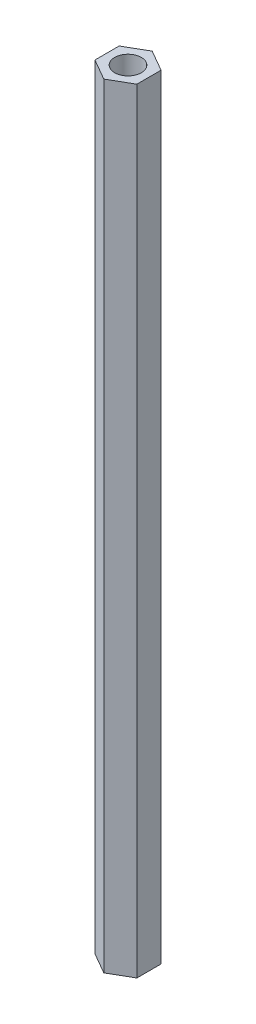
ISO-10303-21;
HEADER;
FILE_DESCRIPTION(('STEP AP214'),'2;1');
FILE_NAME('part.step','',(''),(''),'','','');
FILE_SCHEMA(('AUTOMOTIVE_DESIGN { 1 0 10303 214 1 1 1 1 }'));
ENDSEC;
DATA;
#1=APPLICATION_CONTEXT('core data for automotive mechanical design processes');
#2=APPLICATION_PROTOCOL_DEFINITION('international standard','automotive_design',2000,#1);
#3=PRODUCT_CONTEXT('',#1,'mechanical');
#4=PRODUCT('Part','Part','',(#3));
#5=PRODUCT_RELATED_PRODUCT_CATEGORY('part','',(#4));
#6=PRODUCT_DEFINITION_FORMATION('','',#4);
#7=PRODUCT_DEFINITION_CONTEXT('part definition',#1,'design');
#8=PRODUCT_DEFINITION('design','',#6,#7);
#9=PRODUCT_DEFINITION_SHAPE('','',#8);
#10=(LENGTH_UNIT() NAMED_UNIT(*) SI_UNIT(.MILLI.,.METRE.));
#11=(NAMED_UNIT(*) PLANE_ANGLE_UNIT() SI_UNIT($,.RADIAN.));
#12=(NAMED_UNIT(*) SI_UNIT($,.STERADIAN.) SOLID_ANGLE_UNIT());
#13=UNCERTAINTY_MEASURE_WITH_UNIT(LENGTH_MEASURE(1.E-05),#10,'distance_accuracy_value','');
#14=(GEOMETRIC_REPRESENTATION_CONTEXT(3) GLOBAL_UNCERTAINTY_ASSIGNED_CONTEXT((#13)) GLOBAL_UNIT_ASSIGNED_CONTEXT((#10,
#11,#12)) REPRESENTATION_CONTEXT('',''));
#15=CARTESIAN_POINT('',(0.,0.,0.));
#16=DIRECTION('',(0.,0.,1.));
#17=DIRECTION('',(1.,0.,0.));
#18=AXIS2_PLACEMENT_3D('',#15,#16,#17);
#19=CARTESIAN_POINT('',(0.,101.6,0.));
#20=DIRECTION('',(0.,1.,0.));
#21=DIRECTION('',(0.,0.,1.));
#22=AXIS2_PLACEMENT_3D('',#19,#20,#21);
#23=PLANE('',#22);
#24=DIRECTION('',(0.866025403784438,0.,-0.500000000000001));
#25=VECTOR('',#24,1.);
#26=CARTESIAN_POINT('',(0.,101.6,3.17542648054294));
#27=LINE('',#26,#25);
#28=CARTESIAN_POINT('',(0.,101.6,3.17542648054294));
#29=VERTEX_POINT('',#28);
#30=CARTESIAN_POINT('',(2.75,101.6,1.58771324027147));
#31=VERTEX_POINT('',#30);
#32=EDGE_CURVE('E146',#29,#31,#27,.T.);
#33=ORIENTED_EDGE('',*,*,#32,.T.);
#34=DIRECTION('',(0.,0.,-1.));
#35=VECTOR('',#34,1.);
#36=CARTESIAN_POINT('',(2.75,101.6,1.58771324027147));
#37=LINE('',#36,#35);
#38=CARTESIAN_POINT('',(2.75,101.6,-1.58771324027148));
#39=VERTEX_POINT('',#38);
#40=EDGE_CURVE('E94',#31,#39,#37,.T.);
#41=ORIENTED_EDGE('',*,*,#40,.T.);
#42=DIRECTION('',(-0.866025403784439,0.,-0.499999999999999));
#43=VECTOR('',#42,1.);
#44=CARTESIAN_POINT('',(2.75,101.6,-1.58771324027148));
#45=LINE('',#44,#43);
#46=CARTESIAN_POINT('',(0.,101.6,-3.17542648054294));
#47=VERTEX_POINT('',#46);
#48=EDGE_CURVE('E107',#39,#47,#45,.T.);
#49=ORIENTED_EDGE('',*,*,#48,.T.);
#50=DIRECTION('',(-0.866025403784438,0.,0.500000000000001));
#51=VECTOR('',#50,1.);
#52=CARTESIAN_POINT('',(0.,101.6,-3.17542648054294));
#53=LINE('',#52,#51);
#54=CARTESIAN_POINT('',(-2.75,101.6,-1.58771324027147));
#55=VERTEX_POINT('',#54);
#56=EDGE_CURVE('E101',#47,#55,#53,.T.);
#57=ORIENTED_EDGE('',*,*,#56,.T.);
#58=DIRECTION('',(0.,0.,1.));
#59=VECTOR('',#58,1.);
#60=CARTESIAN_POINT('',(-2.75,101.6,-1.58771324027147));
#61=LINE('',#60,#59);
#62=CARTESIAN_POINT('',(-2.75,101.6,1.58771324027147));
#63=VERTEX_POINT('',#62);
#64=EDGE_CURVE('E105',#55,#63,#61,.T.);
#65=ORIENTED_EDGE('',*,*,#64,.T.);
#66=DIRECTION('',(0.866025403784439,0.,0.499999999999999));
#67=VECTOR('',#66,1.);
#68=CARTESIAN_POINT('',(-2.75,101.6,1.58771324027147));
#69=LINE('',#68,#67);
#70=EDGE_CURVE('E57',#63,#29,#69,.T.);
#71=ORIENTED_EDGE('',*,*,#70,.T.);
#72=EDGE_LOOP('',(#33,#41,#49,#57,#65,#71));
#73=FACE_BOUND('',#72,.T.);
#74=CARTESIAN_POINT('',(0.,101.6,0.));
#75=DIRECTION('',(0.,1.,0.));
#76=DIRECTION('',(0.,0.,1.));
#77=AXIS2_PLACEMENT_3D('',#74,#75,#76);
#78=CIRCLE('',#77,1.75);
#79=CARTESIAN_POINT('',(0.,101.6,1.75));
#80=VERTEX_POINT('',#79);
#81=EDGE_CURVE('E134',#80,#80,#78,.T.);
#82=ORIENTED_EDGE('',*,*,#81,.F.);
#83=EDGE_LOOP('',(#82));
#84=FACE_BOUND('',#83,.T.);
#85=ADVANCED_FACE('F39',(#73,#84),#23,.T.);
#86=CARTESIAN_POINT('',(0.,0.,0.));
#87=DIRECTION('',(0.,1.,0.));
#88=DIRECTION('',(0.,0.,1.));
#89=AXIS2_PLACEMENT_3D('',#86,#87,#88);
#90=PLANE('',#89);
#91=DIRECTION('',(0.866025403784438,0.,-0.500000000000001));
#92=VECTOR('',#91,1.);
#93=CARTESIAN_POINT('',(0.,0.,3.17542648054294));
#94=LINE('',#93,#92);
#95=CARTESIAN_POINT('',(0.,0.,3.17542648054294));
#96=VERTEX_POINT('',#95);
#97=CARTESIAN_POINT('',(2.75,0.,1.58771324027147));
#98=VERTEX_POINT('',#97);
#99=EDGE_CURVE('E129',#96,#98,#94,.T.);
#100=ORIENTED_EDGE('',*,*,#99,.F.);
#101=DIRECTION('',(0.866025403784439,0.,0.499999999999999));
#102=VECTOR('',#101,1.);
#103=CARTESIAN_POINT('',(-2.75,0.,1.58771324027147));
#104=LINE('',#103,#102);
#105=CARTESIAN_POINT('',(-2.75,0.,1.58771324027147));
#106=VERTEX_POINT('',#105);
#107=EDGE_CURVE('E86',#106,#96,#104,.T.);
#108=ORIENTED_EDGE('',*,*,#107,.F.);
#109=DIRECTION('',(0.,0.,1.));
#110=VECTOR('',#109,1.);
#111=CARTESIAN_POINT('',(-2.75,0.,-1.58771324027147));
#112=LINE('',#111,#110);
#113=CARTESIAN_POINT('',(-2.75,0.,-1.58771324027147));
#114=VERTEX_POINT('',#113);
#115=EDGE_CURVE('E80',#114,#106,#112,.T.);
#116=ORIENTED_EDGE('',*,*,#115,.F.);
#117=DIRECTION('',(-0.866025403784438,0.,0.500000000000001));
#118=VECTOR('',#117,1.);
#119=CARTESIAN_POINT('',(0.,0.,-3.17542648054294));
#120=LINE('',#119,#118);
#121=CARTESIAN_POINT('',(0.,0.,-3.17542648054294));
#122=VERTEX_POINT('',#121);
#123=EDGE_CURVE('E116',#122,#114,#120,.T.);
#124=ORIENTED_EDGE('',*,*,#123,.F.);
#125=DIRECTION('',(-0.866025403784439,0.,-0.499999999999999));
#126=VECTOR('',#125,1.);
#127=CARTESIAN_POINT('',(2.75,0.,-1.58771324027148));
#128=LINE('',#127,#126);
#129=CARTESIAN_POINT('',(2.75,0.,-1.58771324027148));
#130=VERTEX_POINT('',#129);
#131=EDGE_CURVE('E137',#130,#122,#128,.T.);
#132=ORIENTED_EDGE('',*,*,#131,.F.);
#133=DIRECTION('',(0.,0.,-1.));
#134=VECTOR('',#133,1.);
#135=CARTESIAN_POINT('',(2.75,0.,1.58771324027147));
#136=LINE('',#135,#134);
#137=EDGE_CURVE('E133',#98,#130,#136,.T.);
#138=ORIENTED_EDGE('',*,*,#137,.F.);
#139=EDGE_LOOP('',(#100,#108,#116,#124,#132,#138));
#140=FACE_BOUND('',#139,.T.);
#141=CARTESIAN_POINT('',(0.,0.,0.));
#142=DIRECTION('',(0.,1.,0.));
#143=DIRECTION('',(0.,0.,1.));
#144=AXIS2_PLACEMENT_3D('',#141,#142,#143);
#145=CIRCLE('',#144,1.75);
#146=CARTESIAN_POINT('',(0.,0.,1.75));
#147=VERTEX_POINT('',#146);
#148=EDGE_CURVE('E243',#147,#147,#145,.T.);
#149=ORIENTED_EDGE('',*,*,#148,.T.);
#150=EDGE_LOOP('',(#149));
#151=FACE_BOUND('',#150,.T.);
#152=ADVANCED_FACE('F159',(#140,#151),#90,.F.);
#153=CARTESIAN_POINT('',(0.,101.6,3.17542648054294));
#154=DIRECTION('',(-0.500000000000001,0.,-0.866025403784438));
#155=DIRECTION('',(-0.866025403784438,0.,0.500000000000001));
#156=AXIS2_PLACEMENT_3D('',#153,#154,#155);
#157=PLANE('',#156);
#158=ORIENTED_EDGE('',*,*,#99,.T.);
#159=DIRECTION('',(0.,-1.,0.));
#160=VECTOR('',#159,1.);
#161=CARTESIAN_POINT('',(2.75,101.6,1.58771324027147));
#162=LINE('',#161,#160);
#163=EDGE_CURVE('E11',#31,#98,#162,.T.);
#164=ORIENTED_EDGE('',*,*,#163,.F.);
#165=ORIENTED_EDGE('',*,*,#32,.F.);
#166=DIRECTION('',(0.,-1.,0.));
#167=VECTOR('',#166,1.);
#168=CARTESIAN_POINT('',(0.,101.6,3.17542648054294));
#169=LINE('',#168,#167);
#170=EDGE_CURVE('E125',#29,#96,#169,.T.);
#171=ORIENTED_EDGE('',*,*,#170,.T.);
#172=EDGE_LOOP('',(#158,#164,#165,#171));
#173=FACE_BOUND('',#172,.T.);
#174=ADVANCED_FACE('F41',(#173),#157,.F.);
#175=CARTESIAN_POINT('',(2.75,101.6,1.58771324027147));
#176=DIRECTION('',(-1.,0.,0.));
#177=DIRECTION('',(0.,0.,1.));
#178=AXIS2_PLACEMENT_3D('',#175,#176,#177);
#179=PLANE('',#178);
#180=ORIENTED_EDGE('',*,*,#137,.T.);
#181=DIRECTION('',(0.,-1.,0.));
#182=VECTOR('',#181,1.);
#183=CARTESIAN_POINT('',(2.75,101.6,-1.58771324027148));
#184=LINE('',#183,#182);
#185=EDGE_CURVE('E49',#39,#130,#184,.T.);
#186=ORIENTED_EDGE('',*,*,#185,.F.);
#187=ORIENTED_EDGE('',*,*,#40,.F.);
#188=ORIENTED_EDGE('',*,*,#163,.T.);
#189=EDGE_LOOP('',(#180,#186,#187,#188));
#190=FACE_BOUND('',#189,.T.);
#191=ADVANCED_FACE('F184',(#190),#179,.F.);
#192=CARTESIAN_POINT('',(2.75,101.6,-1.58771324027148));
#193=DIRECTION('',(-0.499999999999999,0.,0.866025403784439));
#194=DIRECTION('',(0.866025403784439,0.,0.499999999999999));
#195=AXIS2_PLACEMENT_3D('',#192,#193,#194);
#196=PLANE('',#195);
#197=ORIENTED_EDGE('',*,*,#131,.T.);
#198=DIRECTION('',(0.,-1.,0.));
#199=VECTOR('',#198,1.);
#200=CARTESIAN_POINT('',(0.,101.6,-3.17542648054294));
#201=LINE('',#200,#199);
#202=EDGE_CURVE('E118',#47,#122,#201,.T.);
#203=ORIENTED_EDGE('',*,*,#202,.F.);
#204=ORIENTED_EDGE('',*,*,#48,.F.);
#205=ORIENTED_EDGE('',*,*,#185,.T.);
#206=EDGE_LOOP('',(#197,#203,#204,#205));
#207=FACE_BOUND('',#206,.T.);
#208=ADVANCED_FACE('F156',(#207),#196,.F.);
#209=CARTESIAN_POINT('',(0.,101.6,-3.17542648054294));
#210=DIRECTION('',(0.500000000000001,0.,0.866025403784438));
#211=DIRECTION('',(0.866025403784438,0.,-0.500000000000002));
#212=AXIS2_PLACEMENT_3D('',#209,#210,#211);
#213=PLANE('',#212);
#214=ORIENTED_EDGE('',*,*,#123,.T.);
#215=DIRECTION('',(0.,-1.,0.));
#216=VECTOR('',#215,1.);
#217=CARTESIAN_POINT('',(-2.75,101.6,-1.58771324027147));
#218=LINE('',#217,#216);
#219=EDGE_CURVE('E113',#55,#114,#218,.T.);
#220=ORIENTED_EDGE('',*,*,#219,.F.);
#221=ORIENTED_EDGE('',*,*,#56,.F.);
#222=ORIENTED_EDGE('',*,*,#202,.T.);
#223=EDGE_LOOP('',(#214,#220,#221,#222));
#224=FACE_BOUND('',#223,.T.);
#225=ADVANCED_FACE('F114',(#224),#213,.F.);
#226=CARTESIAN_POINT('',(-2.75,101.6,-1.58771324027147));
#227=DIRECTION('',(1.,0.,0.));
#228=DIRECTION('',(0.,0.,-1.));
#229=AXIS2_PLACEMENT_3D('',#226,#227,#228);
#230=PLANE('',#229);
#231=ORIENTED_EDGE('',*,*,#115,.T.);
#232=DIRECTION('',(0.,-1.,0.));
#233=VECTOR('',#232,1.);
#234=CARTESIAN_POINT('',(-2.75,101.6,1.58771324027147));
#235=LINE('',#234,#233);
#236=EDGE_CURVE('E119',#63,#106,#235,.T.);
#237=ORIENTED_EDGE('',*,*,#236,.F.);
#238=ORIENTED_EDGE('',*,*,#64,.F.);
#239=ORIENTED_EDGE('',*,*,#219,.T.);
#240=EDGE_LOOP('',(#231,#237,#238,#239));
#241=FACE_BOUND('',#240,.T.);
#242=ADVANCED_FACE('F121',(#241),#230,.F.);
#243=CARTESIAN_POINT('',(-2.75,101.6,1.58771324027147));
#244=DIRECTION('',(0.499999999999999,0.,-0.866025403784439));
#245=DIRECTION('',(-0.866025403784439,0.,-0.499999999999999));
#246=AXIS2_PLACEMENT_3D('',#243,#244,#245);
#247=PLANE('',#246);
#248=ORIENTED_EDGE('',*,*,#107,.T.);
#249=ORIENTED_EDGE('',*,*,#170,.F.);
#250=ORIENTED_EDGE('',*,*,#70,.F.);
#251=ORIENTED_EDGE('',*,*,#236,.T.);
#252=EDGE_LOOP('',(#248,#249,#250,#251));
#253=FACE_BOUND('',#252,.T.);
#254=ADVANCED_FACE('F164',(#253),#247,.F.);
#255=CARTESIAN_POINT('',(0.,101.6,0.));
#256=DIRECTION('',(0.,-1.,0.));
#257=DIRECTION('',(0.,0.,-1.));
#258=AXIS2_PLACEMENT_3D('',#255,#256,#257);
#259=CYLINDRICAL_SURFACE('',#258,1.75);
#260=ORIENTED_EDGE('',*,*,#81,.T.);
#261=EDGE_LOOP('',(#260));
#262=FACE_BOUND('',#261,.T.);
#263=ORIENTED_EDGE('',*,*,#148,.F.);
#264=EDGE_LOOP('',(#263));
#265=FACE_BOUND('',#264,.T.);
#266=ADVANCED_FACE('F166',(#262,#265),#259,.F.);
#267=CLOSED_SHELL('',(#85,#152,#174,#191,#208,#225,#242,#254,#266));
#268=MANIFOLD_SOLID_BREP('B2',#267);
#269=ADVANCED_BREP_SHAPE_REPRESENTATION('',(#18,#268),#14);
#270=SHAPE_DEFINITION_REPRESENTATION(#9,#269);
ENDSEC;
END-ISO-10303-21;
